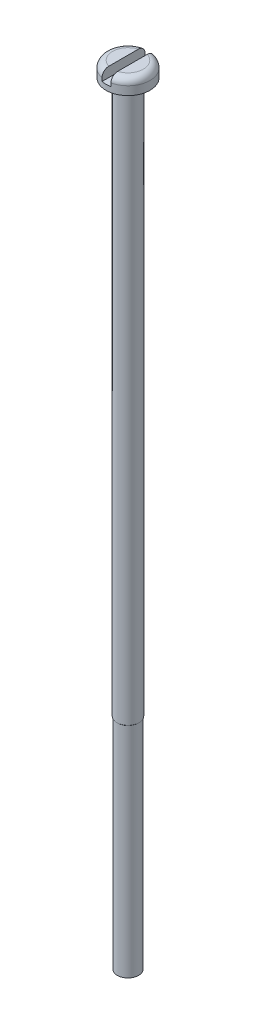
ISO-10303-21;
HEADER;
FILE_DESCRIPTION(('STEP AP214'),'2;1');
FILE_NAME('part.step','',(''),(''),'','','');
FILE_SCHEMA(('AUTOMOTIVE_DESIGN { 1 0 10303 214 1 1 1 1 }'));
ENDSEC;
DATA;
#1=APPLICATION_CONTEXT('core data for automotive mechanical design processes');
#2=APPLICATION_PROTOCOL_DEFINITION('international standard','automotive_design',2000,#1);
#3=PRODUCT_CONTEXT('',#1,'mechanical');
#4=PRODUCT('Part','Part','',(#3));
#5=PRODUCT_RELATED_PRODUCT_CATEGORY('part','',(#4));
#6=PRODUCT_DEFINITION_FORMATION('','',#4);
#7=PRODUCT_DEFINITION_CONTEXT('part definition',#1,'design');
#8=PRODUCT_DEFINITION('design','',#6,#7);
#9=PRODUCT_DEFINITION_SHAPE('','',#8);
#10=(LENGTH_UNIT() NAMED_UNIT(*) SI_UNIT(.MILLI.,.METRE.));
#11=(NAMED_UNIT(*) PLANE_ANGLE_UNIT() SI_UNIT($,.RADIAN.));
#12=(NAMED_UNIT(*) SI_UNIT($,.STERADIAN.) SOLID_ANGLE_UNIT());
#13=UNCERTAINTY_MEASURE_WITH_UNIT(LENGTH_MEASURE(1.E-05),#10,'distance_accuracy_value','');
#14=(GEOMETRIC_REPRESENTATION_CONTEXT(3) GLOBAL_UNCERTAINTY_ASSIGNED_CONTEXT((#13)) GLOBAL_UNIT_ASSIGNED_CONTEXT((#10,
#11,#12)) REPRESENTATION_CONTEXT('',''));
#15=CARTESIAN_POINT('',(0.,0.,0.));
#16=DIRECTION('',(0.,0.,1.));
#17=DIRECTION('',(1.,0.,0.));
#18=AXIS2_PLACEMENT_3D('',#15,#16,#17);
#19=CARTESIAN_POINT('',(0.,118.5,0.));
#20=DIRECTION('',(0.,-1.,0.));
#21=DIRECTION('',(0.,0.,-1.));
#22=AXIS2_PLACEMENT_3D('',#19,#20,#21);
#23=PLANE('',#22);
#24=DIRECTION('',(0.,0.,1.));
#25=VECTOR('',#24,1.);
#26=CARTESIAN_POINT('',(0.679373903068382,118.5,4.3177417754805));
#27=LINE('',#26,#25);
#28=CARTESIAN_POINT('',(0.679373903068382,118.5,3.28038886412069));
#29=VERTEX_POINT('',#28);
#30=CARTESIAN_POINT('',(0.679373903068382,118.5,-3.28038886411804));
#31=VERTEX_POINT('',#30);
#32=EDGE_CURVE('E81',#29,#31,#27,.F.);
#33=ORIENTED_EDGE('',*,*,#32,.T.);
#34=CARTESIAN_POINT('',(0.,118.5,0.));
#35=DIRECTION('',(0.,1.,0.));
#36=DIRECTION('',(-1.,0.,0.));
#37=AXIS2_PLACEMENT_3D('',#34,#35,#36);
#38=CIRCLE('',#37,3.35);
#39=CARTESIAN_POINT('',(-0.67937390306838,118.5,-3.28038886411804));
#40=VERTEX_POINT('',#39);
#41=EDGE_CURVE('E74',#40,#31,#38,.F.);
#42=ORIENTED_EDGE('',*,*,#41,.F.);
#43=DIRECTION('',(0.,0.,1.));
#44=VECTOR('',#43,1.);
#45=CARTESIAN_POINT('',(-0.67937390306838,118.5,4.3177417754805));
#46=LINE('',#45,#44);
#47=CARTESIAN_POINT('',(-0.67937390306838,118.5,3.28038886411804));
#48=VERTEX_POINT('',#47);
#49=EDGE_CURVE('E78',#40,#48,#46,.T.);
#50=ORIENTED_EDGE('',*,*,#49,.T.);
#51=CARTESIAN_POINT('',(0.,118.5,0.));
#52=DIRECTION('',(0.,1.,0.));
#53=DIRECTION('',(-1.,0.,0.));
#54=AXIS2_PLACEMENT_3D('',#51,#52,#53);
#55=CIRCLE('',#54,3.35);
#56=EDGE_CURVE('E84',#29,#48,#55,.F.);
#57=ORIENTED_EDGE('',*,*,#56,.F.);
#58=EDGE_LOOP('',(#33,#42,#50,#57));
#59=FACE_BOUND('',#58,.T.);
#60=ADVANCED_FACE('F18',(#59),#23,.F.);
#61=CARTESIAN_POINT('',(-0.67937390306838,118.5,4.3177417754805));
#62=DIRECTION('',(-1.,0.,0.));
#63=DIRECTION('',(0.,-1.,0.));
#64=AXIS2_PLACEMENT_3D('',#61,#62,#63);
#65=PLANE('',#64);
#66=CARTESIAN_POINT('',(-0.67937390306838,120.,-2.24965577363063));
#67=CARTESIAN_POINT('',(-0.679373903068379,120.000046351855,-2.30923570308519));
#68=CARTESIAN_POINT('',(-0.679373903068379,119.995120429143,-2.3688246900488));
#69=CARTESIAN_POINT('',(-0.679373903068381,119.975461791973,-2.48640275884614));
#70=CARTESIAN_POINT('',(-0.679373903068381,119.960722040274,-2.54439066148574));
#71=CARTESIAN_POINT('',(-0.679373903068381,119.921545596227,-2.65713953730831));
#72=CARTESIAN_POINT('',(-0.67937390306838,119.897094939269,-2.71189573236677));
#73=CARTESIAN_POINT('',(-0.67937390306838,119.853647084443,-2.79015842367086));
#74=CARTESIAN_POINT('',(-0.67937390306838,119.838038576891,-2.81559731032926));
#75=CARTESIAN_POINT('',(-0.67937390306838,119.804641439519,-2.86504164566313));
#76=CARTESIAN_POINT('',(-0.679373903068379,119.786850539611,-2.88904556245201));
#77=CARTESIAN_POINT('',(-0.679373903068378,119.731475013805,-2.9572319634722));
#78=CARTESIAN_POINT('',(-0.679373903068378,119.691023373482,-2.99913764824749));
#79=CARTESIAN_POINT('',(-0.679373903068382,119.603477512605,-3.07530778674829));
#80=CARTESIAN_POINT('',(-0.679373903068384,119.556384960833,-3.10957415457698));
#81=CARTESIAN_POINT('',(-0.679373903068382,119.48252617784,-3.15399423685973));
#82=CARTESIAN_POINT('',(-0.679373903068381,119.457726367781,-3.16749969003309));
#83=CARTESIAN_POINT('',(-0.679373903068379,119.40708841018,-3.19233150345852));
#84=CARTESIAN_POINT('',(-0.67937390306838,119.381251185254,-3.20365975027624));
#85=CARTESIAN_POINT('',(-0.67937390306838,119.302441931454,-3.2342362047474));
#86=CARTESIAN_POINT('',(-0.679373903068376,119.248102498527,-3.25011809181115));
#87=CARTESIAN_POINT('',(-0.679373903068385,119.161108691131,-3.26759221229368));
#88=CARTESIAN_POINT('',(-0.679373903068392,119.129052018507,-3.27238884365665));
#89=CARTESIAN_POINT('',(-0.679373903068368,119.064670572854,-3.27878481513761));
#90=CARTESIAN_POINT('',(-0.679373903068337,119.032346282336,-3.28038901218423));
#91=CARTESIAN_POINT('',(-0.679373903068267,119.,-3.28038886411805));
#92=B_SPLINE_CURVE_WITH_KNOTS('',3,(#66,#67,#68,#69,#70,#71,#72,#73,#74,#75,#76,#77,#78,#79,#80,
#81,#82,#83,#84,#85,#86,#87,#88,#89,#90,#91),.UNSPECIFIED.,.F.,.F.,(4,2,2,2,2,2,2,2,2,2,2,2,4),
(0.,0.178543476469461,0.357215119899182,0.536144634940724,0.625583442845149,0.715116085122793,
0.888934100498483,1.06270851505496,1.14733340284477,1.23188462862377,1.40074577328923,
1.49784925973631,1.59480490089855),.UNSPECIFIED.);
#93=CARTESIAN_POINT('',(-0.67937390306838,120.,-2.24965577363063));
#94=VERTEX_POINT('',#93);
#95=CARTESIAN_POINT('',(-0.679373903068323,119.,-3.28038886411804));
#96=VERTEX_POINT('',#95);
#97=EDGE_CURVE('E94',#94,#96,#92,.T.);
#98=ORIENTED_EDGE('',*,*,#97,.F.);
#99=DIRECTION('',(0.,0.,1.));
#100=VECTOR('',#99,1.);
#101=CARTESIAN_POINT('',(-0.67937390306838,120.,0.));
#102=LINE('',#101,#100);
#103=CARTESIAN_POINT('',(-0.67937390306838,120.,2.24965577363063));
#104=VERTEX_POINT('',#103);
#105=EDGE_CURVE('E187',#104,#94,#102,.F.);
#106=ORIENTED_EDGE('',*,*,#105,.F.);
#107=CARTESIAN_POINT('',(-0.679373903068379,119.000000000002,3.28038886411804));
#108=CARTESIAN_POINT('',(-0.67937390306838,119.027670420112,3.28038889198514));
#109=CARTESIAN_POINT('',(-0.67937390306838,119.055327476066,3.27921525808309));
#110=CARTESIAN_POINT('',(-0.67937390306838,119.110441245194,3.27453462718444));
#111=CARTESIAN_POINT('',(-0.67937390306838,119.137897973834,3.27102781230108));
#112=CARTESIAN_POINT('',(-0.67937390306838,119.219598186765,3.25704803690787));
#113=CARTESIAN_POINT('',(-0.679373903068379,119.273290423786,3.24311560739033));
#114=CARTESIAN_POINT('',(-0.679373903068379,119.377565414514,3.20644622923692));
#115=CARTESIAN_POINT('',(-0.67937390306838,119.428147130785,3.18370636136026));
#116=CARTESIAN_POINT('',(-0.67937390306838,119.524814510568,3.13011530085842));
#117=CARTESIAN_POINT('',(-0.679373903068381,119.570900355409,3.09926443555472));
#118=CARTESIAN_POINT('',(-0.679373903068381,119.657642877533,3.03012918544338));
#119=CARTESIAN_POINT('',(-0.67937390306838,119.698258644853,2.99179353220745));
#120=CARTESIAN_POINT('',(-0.67937390306838,119.772630502971,2.90895941857445));
#121=CARTESIAN_POINT('',(-0.679373903068379,119.806385417677,2.86445990375797));
#122=CARTESIAN_POINT('',(-0.679373903068379,119.866809119932,2.76965198867662));
#123=CARTESIAN_POINT('',(-0.67937390306838,119.893325206419,2.71924642105954));
#124=CARTESIAN_POINT('',(-0.67937390306838,119.937791830972,2.61478476520437));
#125=CARTESIAN_POINT('',(-0.67937390306838,119.955742164378,2.56072858977913));
#126=CARTESIAN_POINT('',(-0.67937390306838,119.97951160727,2.463734521571));
#127=CARTESIAN_POINT('',(-0.67937390306838,119.987208885866,2.42124447328126));
#128=CARTESIAN_POINT('',(-0.67937390306838,119.997453531047,2.33572274704692));
#129=CARTESIAN_POINT('',(-0.67937390306838,120.000009943186,2.29269215473695));
#130=CARTESIAN_POINT('',(-0.67937390306838,120.,2.24965577363063));
#131=B_SPLINE_CURVE_WITH_KNOTS('',3,(#107,#108,#109,#110,#111,#112,#113,#114,#115,#116,#117,
#118,#119,#120,#121,#122,#123,#124,#125,#126,#127,#128,#129,#130),.UNSPECIFIED.,.F.,.F.,(4,2,2,
2,2,2,2,2,2,2,2,4),(0.,0.0829598926420227,0.165913310722958,0.331468537071718,0.497078684012819,
0.662682148737716,0.829462478340842,0.99627137349394,1.16636649130762,1.33646567292582,
1.46571128419372,1.59472928309154),.UNSPECIFIED.);
#132=CARTESIAN_POINT('',(-0.67937390306838,119.000000000003,3.28038886412375));
#133=VERTEX_POINT('',#132);
#134=EDGE_CURVE('E100',#133,#104,#131,.T.);
#135=ORIENTED_EDGE('',*,*,#134,.F.);
#136=DIRECTION('',(0.,-1.,0.));
#137=VECTOR('',#136,1.);
#138=CARTESIAN_POINT('',(-0.67937390306838,118.5,3.28038886411804));
#139=LINE('',#138,#137);
#140=EDGE_CURVE('E98',#48,#133,#139,.F.);
#141=ORIENTED_EDGE('',*,*,#140,.F.);
#142=ORIENTED_EDGE('',*,*,#49,.F.);
#143=DIRECTION('',(0.,-1.,0.));
#144=VECTOR('',#143,1.);
#145=CARTESIAN_POINT('',(-0.67937390306838,118.5,-3.28038886411804));
#146=LINE('',#145,#144);
#147=EDGE_CURVE('E88',#96,#40,#146,.T.);
#148=ORIENTED_EDGE('',*,*,#147,.F.);
#149=EDGE_LOOP('',(#98,#106,#135,#141,#142,#148));
#150=FACE_BOUND('',#149,.T.);
#151=ADVANCED_FACE('F96',(#150),#65,.F.);
#152=CARTESIAN_POINT('',(0.679373903068382,118.5,4.3177417754805));
#153=DIRECTION('',(1.,0.,0.));
#154=DIRECTION('',(0.,1.,0.));
#155=AXIS2_PLACEMENT_3D('',#152,#153,#154);
#156=PLANE('',#155);
#157=ORIENTED_EDGE('',*,*,#32,.F.);
#158=DIRECTION('',(0.,1.,0.));
#159=VECTOR('',#158,1.);
#160=CARTESIAN_POINT('',(0.679373903068382,118.5,3.28038886412335));
#161=LINE('',#160,#159);
#162=CARTESIAN_POINT('',(0.679373903068382,119.,3.28038886412069));
#163=VERTEX_POINT('',#162);
#164=EDGE_CURVE('E114',#163,#29,#161,.F.);
#165=ORIENTED_EDGE('',*,*,#164,.F.);
#166=CARTESIAN_POINT('',(0.679373903068383,120.,2.24965577363063));
#167=CARTESIAN_POINT('',(0.679373903068382,120.000046351855,2.30923570308519));
#168=CARTESIAN_POINT('',(0.679373903068382,119.995120429143,2.3688246900488));
#169=CARTESIAN_POINT('',(0.679373903068382,119.975461791973,2.48640275884614));
#170=CARTESIAN_POINT('',(0.679373903068383,119.960722040274,2.54439066148574));
#171=CARTESIAN_POINT('',(0.679373903068383,119.921545596227,2.65713953730831));
#172=CARTESIAN_POINT('',(0.679373903068382,119.897094939269,2.71189573236677));
#173=CARTESIAN_POINT('',(0.679373903068382,119.853647084443,2.79015842367086));
#174=CARTESIAN_POINT('',(0.679373903068382,119.838038576891,2.81559731032926));
#175=CARTESIAN_POINT('',(0.679373903068382,119.804641439519,2.86504164566313));
#176=CARTESIAN_POINT('',(0.679373903068383,119.786850539611,2.88904556245201));
#177=CARTESIAN_POINT('',(0.679373903068384,119.731475013805,2.9572319634722));
#178=CARTESIAN_POINT('',(0.679373903068382,119.691023373482,2.99913764824749));
#179=CARTESIAN_POINT('',(0.679373903068382,119.603477512605,3.07530778674829));
#180=CARTESIAN_POINT('',(0.679373903068383,119.556384960833,3.10957415457698));
#181=CARTESIAN_POINT('',(0.679373903068383,119.48252617784,3.15399423685973));
#182=CARTESIAN_POINT('',(0.679373903068382,119.457726367781,3.16749969003309));
#183=CARTESIAN_POINT('',(0.679373903068382,119.40708841018,3.19233150345852));
#184=CARTESIAN_POINT('',(0.679373903068382,119.381251185254,3.20365975027624));
#185=CARTESIAN_POINT('',(0.679373903068381,119.302441931454,3.2342362047474));
#186=CARTESIAN_POINT('',(0.679373903068378,119.248102498527,3.25011809181115));
#187=CARTESIAN_POINT('',(0.679373903068387,119.161108691131,3.2675922122937));
#188=CARTESIAN_POINT('',(0.679373903068394,119.129052018506,3.27238884365668));
#189=CARTESIAN_POINT('',(0.67937390306837,119.064670572854,3.27878481513764));
#190=CARTESIAN_POINT('',(0.67937390306834,119.032346282336,3.28038901218425));
#191=CARTESIAN_POINT('',(0.679373903068271,118.999999999999,3.28038886411805));
#192=B_SPLINE_CURVE_WITH_KNOTS('',3,(#166,#167,#168,#169,#170,#171,#172,#173,#174,#175,#176,
#177,#178,#179,#180,#181,#182,#183,#184,#185,#186,#187,#188,#189,#190,#191),.UNSPECIFIED.,.F.,
.F.,(4,2,2,2,2,2,2,2,2,2,2,2,4),(0.,0.178543476469462,0.357215119899182,0.536144634940724,
0.62558344284515,0.715116085122794,0.888934100498484,1.06270851505496,1.14733340284477,
1.23188462862378,1.40074577328924,1.49784925973661,1.59480490089914),.UNSPECIFIED.);
#193=CARTESIAN_POINT('',(0.679373903068382,120.,2.24965577363063));
#194=VERTEX_POINT('',#193);
#195=EDGE_CURVE('E38',#194,#163,#192,.T.);
#196=ORIENTED_EDGE('',*,*,#195,.F.);
#197=DIRECTION('',(0.,0.,1.));
#198=VECTOR('',#197,1.);
#199=CARTESIAN_POINT('',(0.679373903068382,120.,0.));
#200=LINE('',#199,#198);
#201=CARTESIAN_POINT('',(0.679373903068382,120.,-2.24965577363063));
#202=VERTEX_POINT('',#201);
#203=EDGE_CURVE('E189',#202,#194,#200,.T.);
#204=ORIENTED_EDGE('',*,*,#203,.F.);
#205=CARTESIAN_POINT('',(0.679373903068382,119.,-3.28038886411804));
#206=CARTESIAN_POINT('',(0.679373903068382,119.02767042011,-3.28038889198519));
#207=CARTESIAN_POINT('',(0.679373903068382,119.055327476064,-3.2792152580832));
#208=CARTESIAN_POINT('',(0.679373903068382,119.110441245192,-3.27453462718465));
#209=CARTESIAN_POINT('',(0.679373903068382,119.137897973832,-3.27102781230135));
#210=CARTESIAN_POINT('',(0.679373903068382,119.219598186763,-3.2570480369083));
#211=CARTESIAN_POINT('',(0.679373903068383,119.273290423784,-3.24311560739087));
#212=CARTESIAN_POINT('',(0.679373903068383,119.377565414512,-3.20644622923766));
#213=CARTESIAN_POINT('',(0.679373903068383,119.428147130784,-3.1837063613611));
#214=CARTESIAN_POINT('',(0.679373903068381,119.524814510567,-3.13011530085946));
#215=CARTESIAN_POINT('',(0.679373903068381,119.570900355407,-3.09926443555585));
#216=CARTESIAN_POINT('',(0.679373903068381,119.657642877531,-3.03012918544468));
#217=CARTESIAN_POINT('',(0.679373903068382,119.698258644851,-2.99179353220884));
#218=CARTESIAN_POINT('',(0.679373903068382,119.77263050297,-2.90895941857598));
#219=CARTESIAN_POINT('',(0.67937390306838,119.806385417676,-2.86445990375957));
#220=CARTESIAN_POINT('',(0.67937390306838,119.866809119931,-2.76965198867834));
#221=CARTESIAN_POINT('',(0.679373903068381,119.893325206418,-2.71924642106132));
#222=CARTESIAN_POINT('',(0.679373903068383,119.937791830971,-2.61478476520625));
#223=CARTESIAN_POINT('',(0.679373903068385,119.955742164378,-2.56072858978105));
#224=CARTESIAN_POINT('',(0.679373903068384,119.97951160727,-2.46373452157264));
#225=CARTESIAN_POINT('',(0.679373903068383,119.987208885866,-2.42124447328259));
#226=CARTESIAN_POINT('',(0.679373903068381,119.997453531047,-2.33572274704759));
#227=CARTESIAN_POINT('',(0.679373903068381,120.000009943186,-2.29269215473728));
#228=CARTESIAN_POINT('',(0.679373903068383,120.,-2.24965577363063));
#229=B_SPLINE_CURVE_WITH_KNOTS('',3,(#205,#206,#207,#208,#209,#210,#211,#212,#213,#214,#215,
#216,#217,#218,#219,#220,#221,#222,#223,#224,#225,#226,#227,#228),.UNSPECIFIED.,.F.,.F.,(4,2,2,
2,2,2,2,2,2,2,2,4),(0.,0.0829598926420158,0.165913310722931,0.331468537071692,0.497078684012755,
0.662682148737667,0.82946247834077,0.996271373493863,1.16636649130752,1.33646567292571,
1.46571128419461,1.59472928309343),.UNSPECIFIED.);
#230=CARTESIAN_POINT('',(0.679373903068382,119.,-3.28038886411804));
#231=VERTEX_POINT('',#230);
#232=EDGE_CURVE('E93',#231,#202,#229,.T.);
#233=ORIENTED_EDGE('',*,*,#232,.F.);
#234=DIRECTION('',(0.,1.,0.));
#235=VECTOR('',#234,1.);
#236=CARTESIAN_POINT('',(0.679373903068382,118.5,-3.28038886411804));
#237=LINE('',#236,#235);
#238=EDGE_CURVE('E190',#31,#231,#237,.T.);
#239=ORIENTED_EDGE('',*,*,#238,.F.);
#240=EDGE_LOOP('',(#157,#165,#196,#204,#233,#239));
#241=FACE_BOUND('',#240,.T.);
#242=ADVANCED_FACE('F123',(#241),#156,.F.);
#243=CARTESIAN_POINT('',(0.,120.,0.));
#244=DIRECTION('',(0.,1.,0.));
#245=DIRECTION('',(-1.,0.,0.));
#246=AXIS2_PLACEMENT_3D('',#243,#244,#245);
#247=PLANE('',#246);
#248=CARTESIAN_POINT('',(0.,120.,0.));
#249=DIRECTION('',(0.,-1.,0.));
#250=DIRECTION('',(-1.,0.,0.));
#251=AXIS2_PLACEMENT_3D('',#248,#249,#250);
#252=CIRCLE('',#251,2.35);
#253=CARTESIAN_POINT('',(-2.35,120.,0.));
#254=VERTEX_POINT('',#253);
#255=EDGE_CURVE('E194',#254,#94,#252,.T.);
#256=ORIENTED_EDGE('',*,*,#255,.F.);
#257=CARTESIAN_POINT('',(0.,120.,0.));
#258=DIRECTION('',(0.,-1.,0.));
#259=DIRECTION('',(-0.289095277901439,0.,0.957300329204524));
#260=AXIS2_PLACEMENT_3D('',#257,#258,#259);
#261=CIRCLE('',#260,2.35);
#262=EDGE_CURVE('E184',#104,#254,#261,.T.);
#263=ORIENTED_EDGE('',*,*,#262,.F.);
#264=ORIENTED_EDGE('',*,*,#105,.T.);
#265=EDGE_LOOP('',(#256,#263,#264));
#266=FACE_BOUND('',#265,.T.);
#267=ADVANCED_FACE('F193',(#266),#247,.T.);
#268=CARTESIAN_POINT('',(0.,120.,0.));
#269=DIRECTION('',(0.,1.,0.));
#270=DIRECTION('',(-1.,0.,0.));
#271=AXIS2_PLACEMENT_3D('',#268,#269,#270);
#272=PLANE('',#271);
#273=ORIENTED_EDGE('',*,*,#203,.T.);
#274=CARTESIAN_POINT('',(0.,120.,0.));
#275=DIRECTION('',(0.,-1.,0.));
#276=DIRECTION('',(0.289095277901439,0.,-0.957300329204524));
#277=AXIS2_PLACEMENT_3D('',#274,#275,#276);
#278=CIRCLE('',#277,2.35);
#279=EDGE_CURVE('E112',#202,#194,#278,.T.);
#280=ORIENTED_EDGE('',*,*,#279,.F.);
#281=EDGE_LOOP('',(#273,#280));
#282=FACE_BOUND('',#281,.T.);
#283=ADVANCED_FACE('F210',(#282),#272,.T.);
#284=CARTESIAN_POINT('',(-1.62960470877839,0.,0.));
#285=DIRECTION('',(0.,-1.,0.));
#286=DIRECTION('',(1.,0.,0.));
#287=AXIS2_PLACEMENT_3D('',#284,#285,#286);
#288=PLANE('',#287);
#289=CARTESIAN_POINT('',(0.,0.,0.));
#290=DIRECTION('',(0.,1.,0.));
#291=DIRECTION('',(-1.,0.,0.));
#292=AXIS2_PLACEMENT_3D('',#289,#290,#291);
#293=CIRCLE('',#292,1.62960470877838);
#294=CARTESIAN_POINT('',(-1.62960470877838,0.,0.));
#295=VERTEX_POINT('',#294);
#296=EDGE_CURVE('E109',#295,#295,#293,.T.);
#297=ORIENTED_EDGE('',*,*,#296,.F.);
#298=EDGE_LOOP('',(#297));
#299=FACE_BOUND('',#298,.T.);
#300=ADVANCED_FACE('F158',(#299),#288,.T.);
#301=CARTESIAN_POINT('',(0.,119.,0.));
#302=DIRECTION('',(0.,1.,0.));
#303=DIRECTION('',(-1.,0.,0.));
#304=AXIS2_PLACEMENT_3D('',#301,#302,#303);
#305=TOROIDAL_SURFACE('',#304,2.35,1.);
#306=ORIENTED_EDGE('',*,*,#255,.T.);
#307=ORIENTED_EDGE('',*,*,#97,.T.);
#308=CARTESIAN_POINT('',(0.,119.,0.));
#309=DIRECTION('',(0.,1.,0.));
#310=DIRECTION('',(-1.,0.,0.));
#311=AXIS2_PLACEMENT_3D('',#308,#309,#310);
#312=CIRCLE('',#311,3.35);
#313=EDGE_CURVE('E91',#133,#96,#312,.F.);
#314=ORIENTED_EDGE('',*,*,#313,.F.);
#315=ORIENTED_EDGE('',*,*,#134,.T.);
#316=ORIENTED_EDGE('',*,*,#262,.T.);
#317=EDGE_LOOP('',(#306,#307,#314,#315,#316));
#318=FACE_BOUND('',#317,.T.);
#319=ADVANCED_FACE('F132',(#318),#305,.T.);
#320=CARTESIAN_POINT('',(0.,119.,0.));
#321=DIRECTION('',(0.,1.,0.));
#322=DIRECTION('',(-1.,0.,0.));
#323=AXIS2_PLACEMENT_3D('',#320,#321,#322);
#324=TOROIDAL_SURFACE('',#323,2.35,1.);
#325=ORIENTED_EDGE('',*,*,#195,.T.);
#326=CARTESIAN_POINT('',(0.,119.,0.));
#327=DIRECTION('',(0.,1.,0.));
#328=DIRECTION('',(-1.,0.,0.));
#329=AXIS2_PLACEMENT_3D('',#326,#327,#328);
#330=CIRCLE('',#329,3.35);
#331=EDGE_CURVE('E144',#231,#163,#330,.F.);
#332=ORIENTED_EDGE('',*,*,#331,.F.);
#333=ORIENTED_EDGE('',*,*,#232,.T.);
#334=ORIENTED_EDGE('',*,*,#279,.T.);
#335=EDGE_LOOP('',(#325,#332,#333,#334));
#336=FACE_BOUND('',#335,.T.);
#337=ADVANCED_FACE('F126',(#336),#324,.T.);
#338=CARTESIAN_POINT('',(0.,120.,0.));
#339=DIRECTION('',(0.,1.,0.));
#340=DIRECTION('',(-1.,0.,0.));
#341=AXIS2_PLACEMENT_3D('',#338,#339,#340);
#342=CYLINDRICAL_SURFACE('',#341,1.62960470877838);
#343=CARTESIAN_POINT('',(0.,33.329604708797,0.));
#344=DIRECTION('',(0.,1.,0.));
#345=DIRECTION('',(-1.,0.,0.));
#346=AXIS2_PLACEMENT_3D('',#343,#344,#345);
#347=CIRCLE('',#346,1.62960470879625);
#348=CARTESIAN_POINT('',(-1.62960470879625,33.329604708797,0.));
#349=VERTEX_POINT('',#348);
#350=EDGE_CURVE('E108',#349,#349,#347,.T.);
#351=ORIENTED_EDGE('',*,*,#350,.F.);
#352=EDGE_LOOP('',(#351));
#353=FACE_BOUND('',#352,.T.);
#354=ORIENTED_EDGE('',*,*,#296,.T.);
#355=EDGE_LOOP('',(#354));
#356=FACE_BOUND('',#355,.T.);
#357=ADVANCED_FACE('F131',(#353,#356),#342,.T.);
#358=CARTESIAN_POINT('',(0.,120.,0.));
#359=DIRECTION('',(0.,1.,0.));
#360=DIRECTION('',(-1.,0.,0.));
#361=AXIS2_PLACEMENT_3D('',#358,#359,#360);
#362=CYLINDRICAL_SURFACE('',#361,3.35);
#363=CARTESIAN_POINT('',(0.,117.7,0.));
#364=DIRECTION('',(0.,1.,0.));
#365=DIRECTION('',(-1.,0.,0.));
#366=AXIS2_PLACEMENT_3D('',#363,#364,#365);
#367=CIRCLE('',#366,3.35);
#368=CARTESIAN_POINT('',(-3.35,117.7,0.));
#369=VERTEX_POINT('',#368);
#370=EDGE_CURVE('E105',#369,#369,#367,.F.);
#371=ORIENTED_EDGE('',*,*,#370,.F.);
#372=EDGE_LOOP('',(#371));
#373=FACE_BOUND('',#372,.T.);
#374=ORIENTED_EDGE('',*,*,#238,.T.);
#375=ORIENTED_EDGE('',*,*,#331,.T.);
#376=ORIENTED_EDGE('',*,*,#164,.T.);
#377=ORIENTED_EDGE('',*,*,#56,.T.);
#378=ORIENTED_EDGE('',*,*,#140,.T.);
#379=ORIENTED_EDGE('',*,*,#313,.T.);
#380=ORIENTED_EDGE('',*,*,#147,.T.);
#381=ORIENTED_EDGE('',*,*,#41,.T.);
#382=EDGE_LOOP('',(#374,#375,#376,#377,#378,#379,#380,#381));
#383=FACE_BOUND('',#382,.T.);
#384=ADVANCED_FACE('F89',(#373,#383),#362,.T.);
#385=CARTESIAN_POINT('',(0.,33.4000000000856,0.));
#386=DIRECTION('',(0.,1.,0.));
#387=DIRECTION('',(0.,0.,1.));
#388=AXIS2_PLACEMENT_3D('',#385,#386,#387);
#389=CONICAL_SURFACE('',#388,1.7000000001417,0.785398163397448);
#390=CARTESIAN_POINT('',(0.,33.4,0.));
#391=DIRECTION('',(0.,1.,0.));
#392=DIRECTION('',(-1.,0.,0.));
#393=AXIS2_PLACEMENT_3D('',#390,#391,#392);
#394=CIRCLE('',#393,1.69999999999999);
#395=CARTESIAN_POINT('',(-1.69999999999999,33.4,0.));
#396=VERTEX_POINT('',#395);
#397=EDGE_CURVE('E29',#396,#396,#394,.T.);
#398=ORIENTED_EDGE('',*,*,#397,.F.);
#399=EDGE_LOOP('',(#398));
#400=FACE_BOUND('',#399,.T.);
#401=ORIENTED_EDGE('',*,*,#350,.T.);
#402=EDGE_LOOP('',(#401));
#403=FACE_BOUND('',#402,.T.);
#404=ADVANCED_FACE('F261',(#400,#403),#389,.T.);
#405=CARTESIAN_POINT('',(-3.35,117.7,0.));
#406=DIRECTION('',(0.,-1.,0.));
#407=DIRECTION('',(1.,0.,0.));
#408=AXIS2_PLACEMENT_3D('',#405,#406,#407);
#409=PLANE('',#408);
#410=ORIENTED_EDGE('',*,*,#370,.T.);
#411=EDGE_LOOP('',(#410));
#412=FACE_BOUND('',#411,.T.);
#413=CARTESIAN_POINT('',(0.,117.7,0.));
#414=DIRECTION('',(0.,1.,0.));
#415=DIRECTION('',(-1.,0.,0.));
#416=AXIS2_PLACEMENT_3D('',#413,#414,#415);
#417=CIRCLE('',#416,1.69999999999999);
#418=CARTESIAN_POINT('',(-1.69999999999999,117.7,0.));
#419=VERTEX_POINT('',#418);
#420=EDGE_CURVE('E11',#419,#419,#417,.F.);
#421=ORIENTED_EDGE('',*,*,#420,.F.);
#422=EDGE_LOOP('',(#421));
#423=FACE_BOUND('',#422,.T.);
#424=ADVANCED_FACE('F255',(#412,#423),#409,.T.);
#425=CARTESIAN_POINT('',(0.,120.,0.));
#426=DIRECTION('',(0.,1.,0.));
#427=DIRECTION('',(-1.,0.,0.));
#428=AXIS2_PLACEMENT_3D('',#425,#426,#427);
#429=CYLINDRICAL_SURFACE('',#428,1.69999999999999);
#430=ORIENTED_EDGE('',*,*,#420,.T.);
#431=EDGE_LOOP('',(#430));
#432=FACE_BOUND('',#431,.T.);
#433=ORIENTED_EDGE('',*,*,#397,.T.);
#434=EDGE_LOOP('',(#433));
#435=FACE_BOUND('',#434,.T.);
#436=ADVANCED_FACE('F253',(#432,#435),#429,.T.);
#437=CLOSED_SHELL('',(#60,#151,#242,#267,#283,#300,#319,#337,#357,#384,#404,#424,#436));
#438=MANIFOLD_SOLID_BREP('B1',#437);
#439=ADVANCED_BREP_SHAPE_REPRESENTATION('',(#18,#438),#14);
#440=SHAPE_DEFINITION_REPRESENTATION(#9,#439);
ENDSEC;
END-ISO-10303-21;
